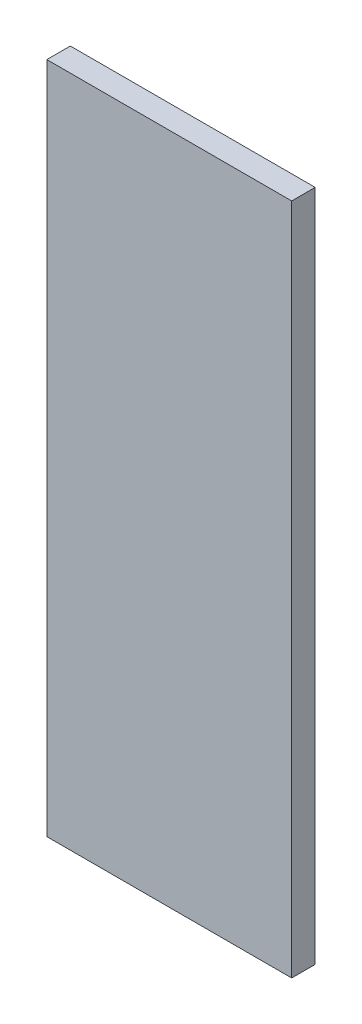
ISO-10303-21;
HEADER;
FILE_DESCRIPTION(('STEP AP214'),'2;1');
FILE_NAME('part.step','',(''),(''),'','','');
FILE_SCHEMA(('AUTOMOTIVE_DESIGN { 1 0 10303 214 1 1 1 1 }'));
ENDSEC;
DATA;
#1=APPLICATION_CONTEXT('core data for automotive mechanical design processes');
#2=APPLICATION_PROTOCOL_DEFINITION('international standard','automotive_design',2000,#1);
#3=PRODUCT_CONTEXT('',#1,'mechanical');
#4=PRODUCT('Part','Part','',(#3));
#5=PRODUCT_RELATED_PRODUCT_CATEGORY('part','',(#4));
#6=PRODUCT_DEFINITION_FORMATION('','',#4);
#7=PRODUCT_DEFINITION_CONTEXT('part definition',#1,'design');
#8=PRODUCT_DEFINITION('design','',#6,#7);
#9=PRODUCT_DEFINITION_SHAPE('','',#8);
#10=(LENGTH_UNIT() NAMED_UNIT(*) SI_UNIT(.MILLI.,.METRE.));
#11=(NAMED_UNIT(*) PLANE_ANGLE_UNIT() SI_UNIT($,.RADIAN.));
#12=(NAMED_UNIT(*) SI_UNIT($,.STERADIAN.) SOLID_ANGLE_UNIT());
#13=UNCERTAINTY_MEASURE_WITH_UNIT(LENGTH_MEASURE(1.E-05),#10,'distance_accuracy_value','');
#14=(GEOMETRIC_REPRESENTATION_CONTEXT(3) GLOBAL_UNCERTAINTY_ASSIGNED_CONTEXT((#13)) GLOBAL_UNIT_ASSIGNED_CONTEXT((#10,
#11,#12)) REPRESENTATION_CONTEXT('',''));
#15=CARTESIAN_POINT('',(0.,0.,0.));
#16=DIRECTION('',(0.,0.,1.));
#17=DIRECTION('',(1.,0.,0.));
#18=AXIS2_PLACEMENT_3D('',#15,#16,#17);
#19=CARTESIAN_POINT('',(0.649751313264501,-0.722568280483534,0.));
#20=DIRECTION('',(0.,-1.,0.));
#21=DIRECTION('',(1.,0.,0.));
#22=AXIS2_PLACEMENT_3D('',#19,#20,#21);
#23=PLANE('',#22);
#24=DIRECTION('',(1.,0.,0.));
#25=VECTOR('',#24,1.);
#26=CARTESIAN_POINT('',(0.649751313264501,-0.722568280483534,0.));
#27=LINE('',#26,#25);
#28=CARTESIAN_POINT('',(0.649751313264501,-0.722568280483534,0.));
#29=VERTEX_POINT('',#28);
#30=CARTESIAN_POINT('',(0.681017376394782,-0.722568280483534,0.));
#31=VERTEX_POINT('',#30);
#32=EDGE_CURVE('E11',#29,#31,#27,.T.);
#33=ORIENTED_EDGE('',*,*,#32,.T.);
#34=DIRECTION('',(0.,0.,1.));
#35=VECTOR('',#34,1.);
#36=CARTESIAN_POINT('',(0.681017376394782,-0.722568280483534,0.));
#37=LINE('',#36,#35);
#38=CARTESIAN_POINT('',(0.681017376394782,-0.722568280483534,0.003));
#39=VERTEX_POINT('',#38);
#40=EDGE_CURVE('E24',#31,#39,#37,.T.);
#41=ORIENTED_EDGE('',*,*,#40,.T.);
#42=DIRECTION('',(1.,0.,0.));
#43=VECTOR('',#42,1.);
#44=CARTESIAN_POINT('',(0.649751313264501,-0.722568280483534,0.003));
#45=LINE('',#44,#43);
#46=CARTESIAN_POINT('',(0.649751313264501,-0.722568280483534,0.003));
#47=VERTEX_POINT('',#46);
#48=EDGE_CURVE('E75',#47,#39,#45,.T.);
#49=ORIENTED_EDGE('',*,*,#48,.F.);
#50=DIRECTION('',(0.,0.,1.));
#51=VECTOR('',#50,1.);
#52=CARTESIAN_POINT('',(0.649751313264501,-0.722568280483534,0.));
#53=LINE('',#52,#51);
#54=EDGE_CURVE('E86',#29,#47,#53,.T.);
#55=ORIENTED_EDGE('',*,*,#54,.F.);
#56=EDGE_LOOP('',(#33,#41,#49,#55));
#57=FACE_BOUND('',#56,.T.);
#58=ADVANCED_FACE('F17',(#57),#23,.T.);
#59=CARTESIAN_POINT('',(0.649751313264501,-0.636643661734989,0.));
#60=DIRECTION('',(-1.,0.,0.));
#61=DIRECTION('',(0.,-1.,0.));
#62=AXIS2_PLACEMENT_3D('',#59,#60,#61);
#63=PLANE('',#62);
#64=DIRECTION('',(0.,-1.,0.));
#65=VECTOR('',#64,1.);
#66=CARTESIAN_POINT('',(0.649751313264501,-0.636643661734989,0.));
#67=LINE('',#66,#65);
#68=CARTESIAN_POINT('',(0.649751313264501,-0.636643661734989,0.));
#69=VERTEX_POINT('',#68);
#70=EDGE_CURVE('E83',#69,#29,#67,.T.);
#71=ORIENTED_EDGE('',*,*,#70,.T.);
#72=ORIENTED_EDGE('',*,*,#54,.T.);
#73=DIRECTION('',(0.,-1.,0.));
#74=VECTOR('',#73,1.);
#75=CARTESIAN_POINT('',(0.649751313264501,-0.636643661734989,0.003));
#76=LINE('',#75,#74);
#77=CARTESIAN_POINT('',(0.649751313264501,-0.636643661734989,0.003));
#78=VERTEX_POINT('',#77);
#79=EDGE_CURVE('E81',#78,#47,#76,.T.);
#80=ORIENTED_EDGE('',*,*,#79,.F.);
#81=DIRECTION('',(0.,0.,1.));
#82=VECTOR('',#81,1.);
#83=CARTESIAN_POINT('',(0.649751313264501,-0.636643661734989,0.));
#84=LINE('',#83,#82);
#85=EDGE_CURVE('E61',#69,#78,#84,.T.);
#86=ORIENTED_EDGE('',*,*,#85,.F.);
#87=EDGE_LOOP('',(#71,#72,#80,#86));
#88=FACE_BOUND('',#87,.T.);
#89=ADVANCED_FACE('F91',(#88),#63,.T.);
#90=CARTESIAN_POINT('',(0.681017376394782,-0.636643661734989,0.));
#91=DIRECTION('',(0.,1.,0.));
#92=DIRECTION('',(-1.,0.,0.));
#93=AXIS2_PLACEMENT_3D('',#90,#91,#92);
#94=PLANE('',#93);
#95=DIRECTION('',(-1.,0.,0.));
#96=VECTOR('',#95,1.);
#97=CARTESIAN_POINT('',(0.681017376394782,-0.636643661734989,0.));
#98=LINE('',#97,#96);
#99=CARTESIAN_POINT('',(0.681017376394782,-0.636643661734989,0.));
#100=VERTEX_POINT('',#99);
#101=EDGE_CURVE('E65',#100,#69,#98,.T.);
#102=ORIENTED_EDGE('',*,*,#101,.T.);
#103=ORIENTED_EDGE('',*,*,#85,.T.);
#104=DIRECTION('',(-1.,0.,0.));
#105=VECTOR('',#104,1.);
#106=CARTESIAN_POINT('',(0.681017376394782,-0.636643661734989,0.003));
#107=LINE('',#106,#105);
#108=CARTESIAN_POINT('',(0.681017376394782,-0.636643661734989,0.003));
#109=VERTEX_POINT('',#108);
#110=EDGE_CURVE('E54',#109,#78,#107,.T.);
#111=ORIENTED_EDGE('',*,*,#110,.F.);
#112=DIRECTION('',(0.,0.,1.));
#113=VECTOR('',#112,1.);
#114=CARTESIAN_POINT('',(0.681017376394782,-0.636643661734989,0.));
#115=LINE('',#114,#113);
#116=EDGE_CURVE('E58',#100,#109,#115,.T.);
#117=ORIENTED_EDGE('',*,*,#116,.F.);
#118=EDGE_LOOP('',(#102,#103,#111,#117));
#119=FACE_BOUND('',#118,.T.);
#120=ADVANCED_FACE('F57',(#119),#94,.T.);
#121=CARTESIAN_POINT('',(0.681017376394782,-0.722568280483534,0.));
#122=DIRECTION('',(1.,0.,0.));
#123=DIRECTION('',(0.,1.,0.));
#124=AXIS2_PLACEMENT_3D('',#121,#122,#123);
#125=PLANE('',#124);
#126=DIRECTION('',(0.,1.,0.));
#127=VECTOR('',#126,1.);
#128=CARTESIAN_POINT('',(0.681017376394782,-0.722568280483534,0.));
#129=LINE('',#128,#127);
#130=EDGE_CURVE('E71',#31,#100,#129,.T.);
#131=ORIENTED_EDGE('',*,*,#130,.T.);
#132=ORIENTED_EDGE('',*,*,#116,.T.);
#133=DIRECTION('',(0.,1.,0.));
#134=VECTOR('',#133,1.);
#135=CARTESIAN_POINT('',(0.681017376394782,-0.722568280483534,0.003));
#136=LINE('',#135,#134);
#137=EDGE_CURVE('E70',#39,#109,#136,.T.);
#138=ORIENTED_EDGE('',*,*,#137,.F.);
#139=ORIENTED_EDGE('',*,*,#40,.F.);
#140=EDGE_LOOP('',(#131,#132,#138,#139));
#141=FACE_BOUND('',#140,.T.);
#142=ADVANCED_FACE('F69',(#141),#125,.T.);
#143=CARTESIAN_POINT('',(0.665384344829641,-0.679605971109262,0.003));
#144=DIRECTION('',(0.,0.,1.));
#145=DIRECTION('',(1.,0.,0.));
#146=AXIS2_PLACEMENT_3D('',#143,#144,#145);
#147=PLANE('',#146);
#148=ORIENTED_EDGE('',*,*,#137,.T.);
#149=ORIENTED_EDGE('',*,*,#110,.T.);
#150=ORIENTED_EDGE('',*,*,#79,.T.);
#151=ORIENTED_EDGE('',*,*,#48,.T.);
#152=EDGE_LOOP('',(#148,#149,#150,#151));
#153=FACE_BOUND('',#152,.T.);
#154=ADVANCED_FACE('F74',(#153),#147,.T.);
#155=CARTESIAN_POINT('',(0.665384344829641,-0.679605971109262,0.));
#156=DIRECTION('',(0.,0.,1.));
#157=DIRECTION('',(1.,0.,0.));
#158=AXIS2_PLACEMENT_3D('',#155,#156,#157);
#159=PLANE('',#158);
#160=ORIENTED_EDGE('',*,*,#130,.F.);
#161=ORIENTED_EDGE('',*,*,#32,.F.);
#162=ORIENTED_EDGE('',*,*,#70,.F.);
#163=ORIENTED_EDGE('',*,*,#101,.F.);
#164=EDGE_LOOP('',(#160,#161,#162,#163));
#165=FACE_BOUND('',#164,.T.);
#166=ADVANCED_FACE('F89',(#165),#159,.F.);
#167=CLOSED_SHELL('',(#58,#89,#120,#142,#154,#166));
#168=MANIFOLD_SOLID_BREP('B1',#167);
#169=ADVANCED_BREP_SHAPE_REPRESENTATION('',(#18,#168),#14);
#170=SHAPE_DEFINITION_REPRESENTATION(#9,#169);
ENDSEC;
END-ISO-10303-21;
